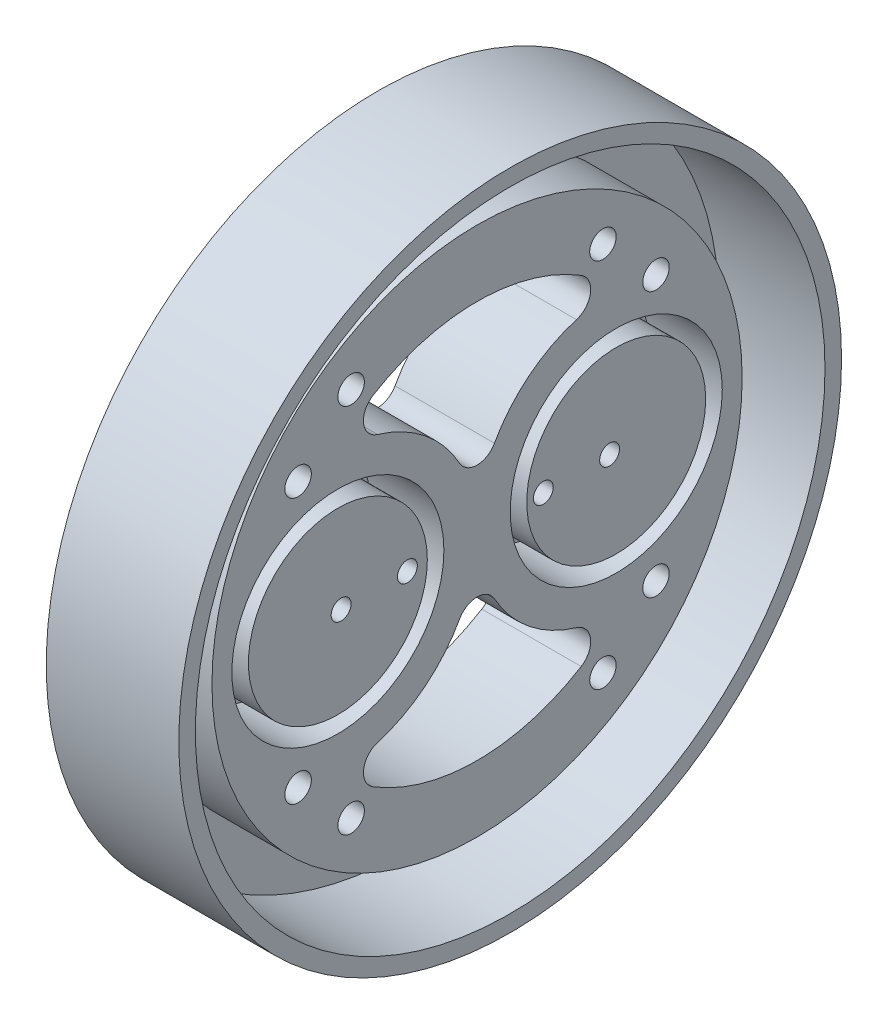
ISO-10303-21;
HEADER;
FILE_DESCRIPTION(('STEP AP214'),'2;1');
FILE_NAME('part.step','',(''),(''),'','','');
FILE_SCHEMA(('AUTOMOTIVE_DESIGN { 1 0 10303 214 1 1 1 1 }'));
ENDSEC;
DATA;
#1=APPLICATION_CONTEXT('core data for automotive mechanical design processes');
#2=APPLICATION_PROTOCOL_DEFINITION('international standard','automotive_design',2000,#1);
#3=PRODUCT_CONTEXT('',#1,'mechanical');
#4=PRODUCT('Part','Part','',(#3));
#5=PRODUCT_RELATED_PRODUCT_CATEGORY('part','',(#4));
#6=PRODUCT_DEFINITION_FORMATION('','',#4);
#7=PRODUCT_DEFINITION_CONTEXT('part definition',#1,'design');
#8=PRODUCT_DEFINITION('design','',#6,#7);
#9=PRODUCT_DEFINITION_SHAPE('','',#8);
#10=(LENGTH_UNIT() NAMED_UNIT(*) SI_UNIT(.MILLI.,.METRE.));
#11=(NAMED_UNIT(*) PLANE_ANGLE_UNIT() SI_UNIT($,.RADIAN.));
#12=(NAMED_UNIT(*) SI_UNIT($,.STERADIAN.) SOLID_ANGLE_UNIT());
#13=UNCERTAINTY_MEASURE_WITH_UNIT(LENGTH_MEASURE(1.E-05),#10,'distance_accuracy_value','');
#14=(GEOMETRIC_REPRESENTATION_CONTEXT(3) GLOBAL_UNCERTAINTY_ASSIGNED_CONTEXT((#13)) GLOBAL_UNIT_ASSIGNED_CONTEXT((#10,
#11,#12)) REPRESENTATION_CONTEXT('',''));
#15=CARTESIAN_POINT('',(0.,0.,0.));
#16=DIRECTION('',(0.,0.,1.));
#17=DIRECTION('',(1.,0.,0.));
#18=AXIS2_PLACEMENT_3D('',#15,#16,#17);
#19=CARTESIAN_POINT('',(4.,0.,0.));
#20=DIRECTION('',(1.,0.,0.));
#21=DIRECTION('',(0.,0.,-1.));
#22=AXIS2_PLACEMENT_3D('',#19,#20,#21);
#23=PLANE('',#22);
#24=CARTESIAN_POINT('',(4.,0.,0.));
#25=DIRECTION('',(1.,0.,0.));
#26=DIRECTION('',(0.,0.,-1.));
#27=AXIS2_PLACEMENT_3D('',#24,#25,#26);
#28=CIRCLE('',#27,47.5);
#29=CARTESIAN_POINT('',(4.,0.,-47.5));
#30=VERTEX_POINT('',#29);
#31=EDGE_CURVE('E261',#30,#30,#28,.T.);
#32=ORIENTED_EDGE('',*,*,#31,.T.);
#33=EDGE_LOOP('',(#32));
#34=FACE_BOUND('',#33,.T.);
#35=CARTESIAN_POINT('',(4.,0.,0.));
#36=DIRECTION('',(1.,0.,0.));
#37=DIRECTION('',(0.,0.,-1.));
#38=AXIS2_PLACEMENT_3D('',#35,#36,#37);
#39=CIRCLE('',#38,40.);
#40=CARTESIAN_POINT('',(4.,0.,-40.));
#41=VERTEX_POINT('',#40);
#42=EDGE_CURVE('E207',#41,#41,#39,.F.);
#43=ORIENTED_EDGE('',*,*,#42,.T.);
#44=EDGE_LOOP('',(#43));
#45=FACE_BOUND('',#44,.T.);
#46=ADVANCED_FACE('F53',(#34,#45),#23,.T.);
#47=CARTESIAN_POINT('',(20.,0.,0.));
#48=DIRECTION('',(-1.,0.,0.));
#49=DIRECTION('',(0.,0.,1.));
#50=AXIS2_PLACEMENT_3D('',#47,#48,#49);
#51=CYLINDRICAL_SURFACE('',#50,47.5);
#52=ORIENTED_EDGE('',*,*,#31,.F.);
#53=EDGE_LOOP('',(#52));
#54=FACE_BOUND('',#53,.T.);
#55=CARTESIAN_POINT('',(20.,0.,0.));
#56=DIRECTION('',(1.,0.,0.));
#57=DIRECTION('',(0.,0.,-1.));
#58=AXIS2_PLACEMENT_3D('',#55,#56,#57);
#59=CIRCLE('',#58,47.5);
#60=CARTESIAN_POINT('',(20.,0.,-47.5));
#61=VERTEX_POINT('',#60);
#62=EDGE_CURVE('E265',#61,#61,#59,.T.);
#63=ORIENTED_EDGE('',*,*,#62,.T.);
#64=EDGE_LOOP('',(#63));
#65=FACE_BOUND('',#64,.T.);
#66=ADVANCED_FACE('F55',(#54,#65),#51,.F.);
#67=CARTESIAN_POINT('',(20.,0.,0.));
#68=DIRECTION('',(-1.,0.,0.));
#69=DIRECTION('',(0.,0.,1.));
#70=AXIS2_PLACEMENT_3D('',#67,#68,#69);
#71=CYLINDRICAL_SURFACE('',#70,50.);
#72=CARTESIAN_POINT('',(20.,0.,0.));
#73=DIRECTION('',(1.,0.,0.));
#74=DIRECTION('',(0.,0.,-1.));
#75=AXIS2_PLACEMENT_3D('',#72,#73,#74);
#76=CIRCLE('',#75,50.);
#77=CARTESIAN_POINT('',(20.,0.,-50.));
#78=VERTEX_POINT('',#77);
#79=EDGE_CURVE('E264',#78,#78,#76,.T.);
#80=ORIENTED_EDGE('',*,*,#79,.F.);
#81=EDGE_LOOP('',(#80));
#82=FACE_BOUND('',#81,.T.);
#83=CARTESIAN_POINT('',(0.,0.,0.));
#84=DIRECTION('',(1.,0.,0.));
#85=DIRECTION('',(0.,0.,-1.));
#86=AXIS2_PLACEMENT_3D('',#83,#84,#85);
#87=CIRCLE('',#86,50.);
#88=CARTESIAN_POINT('',(0.,0.,-50.));
#89=VERTEX_POINT('',#88);
#90=EDGE_CURVE('E251',#89,#89,#87,.T.);
#91=ORIENTED_EDGE('',*,*,#90,.T.);
#92=EDGE_LOOP('',(#91));
#93=FACE_BOUND('',#92,.T.);
#94=ADVANCED_FACE('F401',(#82,#93),#71,.T.);
#95=CARTESIAN_POINT('',(20.,0.,0.));
#96=DIRECTION('',(1.,0.,0.));
#97=DIRECTION('',(0.,0.,-1.));
#98=AXIS2_PLACEMENT_3D('',#95,#96,#97);
#99=PLANE('',#98);
#100=ORIENTED_EDGE('',*,*,#62,.F.);
#101=EDGE_LOOP('',(#100));
#102=FACE_BOUND('',#101,.T.);
#103=ORIENTED_EDGE('',*,*,#79,.T.);
#104=EDGE_LOOP('',(#103));
#105=FACE_BOUND('',#104,.T.);
#106=ADVANCED_FACE('F451',(#102,#105),#99,.T.);
#107=CARTESIAN_POINT('',(0.,0.,0.));
#108=DIRECTION('',(1.,0.,0.));
#109=DIRECTION('',(0.,0.,-1.));
#110=AXIS2_PLACEMENT_3D('',#107,#108,#109);
#111=PLANE('',#110);
#112=CARTESIAN_POINT('',(0.,-28.,19.));
#113=DIRECTION('',(1.,0.,0.));
#114=DIRECTION('',(0.,0.,-1.));
#115=AXIS2_PLACEMENT_3D('',#112,#113,#114);
#116=CIRCLE('',#115,2.);
#117=CARTESIAN_POINT('',(0.,-28.,17.));
#118=VERTEX_POINT('',#117);
#119=EDGE_CURVE('E338',#118,#118,#116,.T.);
#120=ORIENTED_EDGE('',*,*,#119,.T.);
#121=EDGE_LOOP('',(#120));
#122=FACE_BOUND('',#121,.T.);
#123=CARTESIAN_POINT('',(0.,0.,20.508));
#124=DIRECTION('',(1.,0.,0.));
#125=DIRECTION('',(0.,0.,-1.));
#126=AXIS2_PLACEMENT_3D('',#123,#124,#125);
#127=CIRCLE('',#126,1.5);
#128=CARTESIAN_POINT('',(0.,0.,19.008));
#129=VERTEX_POINT('',#128);
#130=EDGE_CURVE('E332',#129,#129,#127,.T.);
#131=ORIENTED_EDGE('',*,*,#130,.T.);
#132=EDGE_LOOP('',(#131));
#133=FACE_BOUND('',#132,.T.);
#134=CARTESIAN_POINT('',(0.,0.,10.508));
#135=DIRECTION('',(1.,0.,0.));
#136=DIRECTION('',(0.,0.,-1.));
#137=AXIS2_PLACEMENT_3D('',#134,#135,#136);
#138=CIRCLE('',#137,1.5);
#139=CARTESIAN_POINT('',(0.,0.,9.008));
#140=VERTEX_POINT('',#139);
#141=EDGE_CURVE('E326',#140,#140,#138,.T.);
#142=ORIENTED_EDGE('',*,*,#141,.T.);
#143=EDGE_LOOP('',(#142));
#144=FACE_BOUND('',#143,.T.);
#145=CARTESIAN_POINT('',(0.,0.,-10.));
#146=DIRECTION('',(1.,0.,0.));
#147=DIRECTION('',(0.,0.,-1.));
#148=AXIS2_PLACEMENT_3D('',#145,#146,#147);
#149=CIRCLE('',#148,1.5);
#150=CARTESIAN_POINT('',(0.,0.,-11.5));
#151=VERTEX_POINT('',#150);
#152=EDGE_CURVE('E320',#151,#151,#149,.T.);
#153=ORIENTED_EDGE('',*,*,#152,.T.);
#154=EDGE_LOOP('',(#153));
#155=FACE_BOUND('',#154,.T.);
#156=CARTESIAN_POINT('',(0.,0.,-20.));
#157=DIRECTION('',(1.,0.,0.));
#158=DIRECTION('',(0.,0.,-1.));
#159=AXIS2_PLACEMENT_3D('',#156,#157,#158);
#160=CIRCLE('',#159,1.5);
#161=CARTESIAN_POINT('',(0.,0.,-21.5));
#162=VERTEX_POINT('',#161);
#163=EDGE_CURVE('E314',#162,#162,#160,.T.);
#164=ORIENTED_EDGE('',*,*,#163,.T.);
#165=EDGE_LOOP('',(#164));
#166=FACE_BOUND('',#165,.T.);
#167=CARTESIAN_POINT('',(0.,-28.,-19.));
#168=DIRECTION('',(1.,0.,0.));
#169=DIRECTION('',(0.,0.,1.));
#170=AXIS2_PLACEMENT_3D('',#167,#168,#169);
#171=CIRCLE('',#170,2.);
#172=CARTESIAN_POINT('',(0.,-28.,-17.));
#173=VERTEX_POINT('',#172);
#174=EDGE_CURVE('E308',#173,#173,#171,.T.);
#175=ORIENTED_EDGE('',*,*,#174,.T.);
#176=EDGE_LOOP('',(#175));
#177=FACE_BOUND('',#176,.T.);
#178=CARTESIAN_POINT('',(0.,-20.,-27.));
#179=DIRECTION('',(1.,0.,0.));
#180=DIRECTION('',(0.,0.,1.));
#181=AXIS2_PLACEMENT_3D('',#178,#179,#180);
#182=CIRCLE('',#181,2.);
#183=CARTESIAN_POINT('',(0.,-20.,-25.));
#184=VERTEX_POINT('',#183);
#185=EDGE_CURVE('E302',#184,#184,#182,.T.);
#186=ORIENTED_EDGE('',*,*,#185,.T.);
#187=EDGE_LOOP('',(#186));
#188=FACE_BOUND('',#187,.T.);
#189=CARTESIAN_POINT('',(0.,20.,-27.));
#190=DIRECTION('',(1.,0.,0.));
#191=DIRECTION('',(0.,0.,-1.));
#192=AXIS2_PLACEMENT_3D('',#189,#190,#191);
#193=CIRCLE('',#192,2.);
#194=CARTESIAN_POINT('',(0.,20.,-29.));
#195=VERTEX_POINT('',#194);
#196=EDGE_CURVE('E295',#195,#195,#193,.T.);
#197=ORIENTED_EDGE('',*,*,#196,.T.);
#198=EDGE_LOOP('',(#197));
#199=FACE_BOUND('',#198,.T.);
#200=CARTESIAN_POINT('',(0.,28.,-19.));
#201=DIRECTION('',(1.,0.,0.));
#202=DIRECTION('',(0.,0.,-1.));
#203=AXIS2_PLACEMENT_3D('',#200,#201,#202);
#204=CIRCLE('',#203,2.);
#205=CARTESIAN_POINT('',(0.,28.,-21.));
#206=VERTEX_POINT('',#205);
#207=EDGE_CURVE('E355',#206,#206,#204,.T.);
#208=ORIENTED_EDGE('',*,*,#207,.T.);
#209=EDGE_LOOP('',(#208));
#210=FACE_BOUND('',#209,.T.);
#211=CARTESIAN_POINT('',(0.,28.,19.));
#212=DIRECTION('',(1.,0.,0.));
#213=DIRECTION('',(0.,0.,1.));
#214=AXIS2_PLACEMENT_3D('',#211,#212,#213);
#215=CIRCLE('',#214,2.);
#216=CARTESIAN_POINT('',(0.,28.,21.));
#217=VERTEX_POINT('',#216);
#218=EDGE_CURVE('E349',#217,#217,#215,.T.);
#219=ORIENTED_EDGE('',*,*,#218,.T.);
#220=EDGE_LOOP('',(#219));
#221=FACE_BOUND('',#220,.T.);
#222=CARTESIAN_POINT('',(0.,20.,27.));
#223=DIRECTION('',(1.,0.,0.));
#224=DIRECTION('',(0.,0.,1.));
#225=AXIS2_PLACEMENT_3D('',#222,#223,#224);
#226=CIRCLE('',#225,2.);
#227=CARTESIAN_POINT('',(0.,20.,29.));
#228=VERTEX_POINT('',#227);
#229=EDGE_CURVE('E343',#228,#228,#226,.T.);
#230=ORIENTED_EDGE('',*,*,#229,.T.);
#231=EDGE_LOOP('',(#230));
#232=FACE_BOUND('',#231,.T.);
#233=CARTESIAN_POINT('',(0.,-20.,27.));
#234=DIRECTION('',(1.,0.,0.));
#235=DIRECTION('',(0.,0.,-1.));
#236=AXIS2_PLACEMENT_3D('',#233,#234,#235);
#237=CIRCLE('',#236,2.);
#238=CARTESIAN_POINT('',(0.,-20.,25.));
#239=VERTEX_POINT('',#238);
#240=EDGE_CURVE('E286',#239,#239,#237,.T.);
#241=ORIENTED_EDGE('',*,*,#240,.T.);
#242=EDGE_LOOP('',(#241));
#243=FACE_BOUND('',#242,.T.);
#244=ORIENTED_EDGE('',*,*,#90,.F.);
#245=EDGE_LOOP('',(#244));
#246=FACE_BOUND('',#245,.T.);
#247=CARTESIAN_POINT('',(0.,0.,-21.));
#248=DIRECTION('',(1.,0.,0.));
#249=DIRECTION('',(0.,0.,-1.));
#250=AXIS2_PLACEMENT_3D('',#247,#248,#249);
#251=CIRCLE('',#250,21.);
#252=CARTESIAN_POINT('',(0.,10.1665812837945,-2.625));
#253=VERTEX_POINT('',#252);
#254=CARTESIAN_POINT('',(0.,20.1246117974981,-15.));
#255=VERTEX_POINT('',#254);
#256=EDGE_CURVE('E150',#253,#255,#251,.F.);
#257=ORIENTED_EDGE('',*,*,#256,.T.);
#258=CARTESIAN_POINT('',(0.,22.9995563399978,-14.1428571428571));
#259=DIRECTION('',(1.,0.,0.));
#260=DIRECTION('',(0.,0.,-1.));
#261=AXIS2_PLACEMENT_3D('',#258,#259,#260);
#262=CIRCLE('',#261,3.);
#263=CARTESIAN_POINT('',(0.,25.5550625999976,-15.7142857142857));
#264=VERTEX_POINT('',#263);
#265=EDGE_CURVE('E221',#255,#264,#262,.T.);
#266=ORIENTED_EDGE('',*,*,#265,.T.);
#267=CARTESIAN_POINT('',(0.,0.,0.));
#268=DIRECTION('',(1.,0.,0.));
#269=DIRECTION('',(0.,0.,-1.));
#270=AXIS2_PLACEMENT_3D('',#267,#268,#269);
#271=CIRCLE('',#270,30.);
#272=CARTESIAN_POINT('',(0.,25.5550625999976,15.7142857142857));
#273=VERTEX_POINT('',#272);
#274=EDGE_CURVE('E218',#264,#273,#271,.T.);
#275=ORIENTED_EDGE('',*,*,#274,.T.);
#276=CARTESIAN_POINT('',(0.,22.9995563399978,14.1428571428571));
#277=DIRECTION('',(1.,0.,0.));
#278=DIRECTION('',(0.,0.,-1.));
#279=AXIS2_PLACEMENT_3D('',#276,#277,#278);
#280=CIRCLE('',#279,3.);
#281=CARTESIAN_POINT('',(0.,20.1246117974981,15.));
#282=VERTEX_POINT('',#281);
#283=EDGE_CURVE('E215',#282,#273,#280,.F.);
#284=ORIENTED_EDGE('',*,*,#283,.F.);
#285=CARTESIAN_POINT('',(0.,0.,21.));
#286=DIRECTION('',(1.,0.,0.));
#287=DIRECTION('',(0.,0.,-1.));
#288=AXIS2_PLACEMENT_3D('',#285,#286,#287);
#289=CIRCLE('',#288,21.);
#290=CARTESIAN_POINT('',(0.,10.1665812837945,2.625));
#291=VERTEX_POINT('',#290);
#292=EDGE_CURVE('E212',#291,#282,#289,.T.);
#293=ORIENTED_EDGE('',*,*,#292,.F.);
#294=CARTESIAN_POINT('',(0.,11.6189500386222,0.));
#295=DIRECTION('',(1.,0.,0.));
#296=DIRECTION('',(0.,0.,-1.));
#297=AXIS2_PLACEMENT_3D('',#294,#295,#296);
#298=CIRCLE('',#297,3.);
#299=EDGE_CURVE('E209',#291,#253,#298,.T.);
#300=ORIENTED_EDGE('',*,*,#299,.T.);
#301=EDGE_LOOP('',(#257,#266,#275,#284,#293,#300));
#302=FACE_BOUND('',#301,.T.);
#303=CARTESIAN_POINT('',(0.,0.,-21.));
#304=DIRECTION('',(1.,0.,0.));
#305=DIRECTION('',(0.,0.,-1.));
#306=AXIS2_PLACEMENT_3D('',#303,#304,#305);
#307=CIRCLE('',#306,21.);
#308=CARTESIAN_POINT('',(0.,-20.1246117974981,-15.));
#309=VERTEX_POINT('',#308);
#310=CARTESIAN_POINT('',(0.,-10.1665812837945,-2.62500000000001));
#311=VERTEX_POINT('',#310);
#312=EDGE_CURVE('E224',#309,#311,#307,.F.);
#313=ORIENTED_EDGE('',*,*,#312,.T.);
#314=CARTESIAN_POINT('',(0.,-11.6189500386222,0.));
#315=DIRECTION('',(1.,0.,0.));
#316=DIRECTION('',(0.,0.,-1.));
#317=AXIS2_PLACEMENT_3D('',#314,#315,#316);
#318=CIRCLE('',#317,3.);
#319=CARTESIAN_POINT('',(0.,-10.1665812837945,2.62500000000001));
#320=VERTEX_POINT('',#319);
#321=EDGE_CURVE('E237',#311,#320,#318,.T.);
#322=ORIENTED_EDGE('',*,*,#321,.T.);
#323=CARTESIAN_POINT('',(0.,0.,21.));
#324=DIRECTION('',(1.,0.,0.));
#325=DIRECTION('',(0.,0.,-1.));
#326=AXIS2_PLACEMENT_3D('',#323,#324,#325);
#327=CIRCLE('',#326,21.);
#328=CARTESIAN_POINT('',(0.,-20.1246117974981,15.));
#329=VERTEX_POINT('',#328);
#330=EDGE_CURVE('E235',#329,#320,#327,.T.);
#331=ORIENTED_EDGE('',*,*,#330,.F.);
#332=CARTESIAN_POINT('',(0.,-22.9995563399978,14.1428571428571));
#333=DIRECTION('',(1.,0.,0.));
#334=DIRECTION('',(0.,0.,-1.));
#335=AXIS2_PLACEMENT_3D('',#332,#333,#334);
#336=CIRCLE('',#335,3.);
#337=CARTESIAN_POINT('',(0.,-25.5550625999976,15.7142857142857));
#338=VERTEX_POINT('',#337);
#339=EDGE_CURVE('E232',#329,#338,#336,.T.);
#340=ORIENTED_EDGE('',*,*,#339,.T.);
#341=CARTESIAN_POINT('',(0.,0.,0.));
#342=DIRECTION('',(1.,0.,0.));
#343=DIRECTION('',(0.,0.,-1.));
#344=AXIS2_PLACEMENT_3D('',#341,#342,#343);
#345=CIRCLE('',#344,30.);
#346=CARTESIAN_POINT('',(0.,-25.5550625999976,-15.7142857142857));
#347=VERTEX_POINT('',#346);
#348=EDGE_CURVE('E229',#338,#347,#345,.T.);
#349=ORIENTED_EDGE('',*,*,#348,.T.);
#350=CARTESIAN_POINT('',(0.,-22.9995563399978,-14.1428571428571));
#351=DIRECTION('',(1.,0.,0.));
#352=DIRECTION('',(0.,0.,-1.));
#353=AXIS2_PLACEMENT_3D('',#350,#351,#352);
#354=CIRCLE('',#353,3.);
#355=EDGE_CURVE('E226',#309,#347,#354,.F.);
#356=ORIENTED_EDGE('',*,*,#355,.F.);
#357=EDGE_LOOP('',(#313,#322,#331,#340,#349,#356));
#358=FACE_BOUND('',#357,.T.);
#359=ADVANCED_FACE('F449',(#122,#133,#144,#155,#166,#177,#188,#199,#210,#221,#232,#243,#246,
#302,#358),#111,.F.);
#360=CARTESIAN_POINT('',(4.,0.,-21.));
#361=DIRECTION('',(-1.,0.,0.));
#362=DIRECTION('',(0.,0.,1.));
#363=AXIS2_PLACEMENT_3D('',#360,#361,#362);
#364=CYLINDRICAL_SURFACE('',#363,21.);
#365=ORIENTED_EDGE('',*,*,#312,.F.);
#366=DIRECTION('',(-1.,0.,0.));
#367=VECTOR('',#366,1.);
#368=CARTESIAN_POINT('',(4.,-20.1246117974981,-15.));
#369=LINE('',#368,#367);
#370=CARTESIAN_POINT('',(15.,-20.1246117974981,-15.));
#371=VERTEX_POINT('',#370);
#372=EDGE_CURVE('E249',#371,#309,#369,.T.);
#373=ORIENTED_EDGE('',*,*,#372,.F.);
#374=CARTESIAN_POINT('',(15.,0.,-21.));
#375=DIRECTION('',(1.,0.,0.));
#376=DIRECTION('',(0.,0.,-1.));
#377=AXIS2_PLACEMENT_3D('',#374,#375,#376);
#378=CIRCLE('',#377,21.);
#379=CARTESIAN_POINT('',(15.,-10.1665812837945,-2.62500000000001));
#380=VERTEX_POINT('',#379);
#381=EDGE_CURVE('E191',#371,#380,#378,.F.);
#382=ORIENTED_EDGE('',*,*,#381,.T.);
#383=DIRECTION('',(-1.,0.,0.));
#384=VECTOR('',#383,1.);
#385=CARTESIAN_POINT('',(4.,-10.1665812837945,-2.62500000000001));
#386=LINE('',#385,#384);
#387=EDGE_CURVE('E68',#380,#311,#386,.T.);
#388=ORIENTED_EDGE('',*,*,#387,.T.);
#389=EDGE_LOOP('',(#365,#373,#382,#388));
#390=FACE_BOUND('',#389,.T.);
#391=ADVANCED_FACE('F433',(#390),#364,.T.);
#392=CARTESIAN_POINT('',(4.,-22.9995563399978,-14.1428571428571));
#393=DIRECTION('',(-1.,0.,0.));
#394=DIRECTION('',(0.,0.,1.));
#395=AXIS2_PLACEMENT_3D('',#392,#393,#394);
#396=CYLINDRICAL_SURFACE('',#395,3.);
#397=ORIENTED_EDGE('',*,*,#355,.T.);
#398=DIRECTION('',(-1.,0.,0.));
#399=VECTOR('',#398,1.);
#400=CARTESIAN_POINT('',(4.,-25.5550625999976,-15.7142857142857));
#401=LINE('',#400,#399);
#402=CARTESIAN_POINT('',(15.,-25.5550625999976,-15.7142857142857));
#403=VERTEX_POINT('',#402);
#404=EDGE_CURVE('E247',#403,#347,#401,.T.);
#405=ORIENTED_EDGE('',*,*,#404,.F.);
#406=CARTESIAN_POINT('',(15.,-22.9995563399978,-14.1428571428571));
#407=DIRECTION('',(1.,0.,0.));
#408=DIRECTION('',(0.,0.,-1.));
#409=AXIS2_PLACEMENT_3D('',#406,#407,#408);
#410=CIRCLE('',#409,3.);
#411=EDGE_CURVE('E193',#371,#403,#410,.F.);
#412=ORIENTED_EDGE('',*,*,#411,.F.);
#413=ORIENTED_EDGE('',*,*,#372,.T.);
#414=EDGE_LOOP('',(#397,#405,#412,#413));
#415=FACE_BOUND('',#414,.T.);
#416=ADVANCED_FACE('F436',(#415),#396,.F.);
#417=CARTESIAN_POINT('',(4.,0.,0.));
#418=DIRECTION('',(-1.,0.,0.));
#419=DIRECTION('',(0.,0.,1.));
#420=AXIS2_PLACEMENT_3D('',#417,#418,#419);
#421=CYLINDRICAL_SURFACE('',#420,30.);
#422=ORIENTED_EDGE('',*,*,#348,.F.);
#423=DIRECTION('',(-1.,0.,0.));
#424=VECTOR('',#423,1.);
#425=CARTESIAN_POINT('',(4.,-25.5550625999976,15.7142857142857));
#426=LINE('',#425,#424);
#427=CARTESIAN_POINT('',(15.,-25.5550625999976,15.7142857142857));
#428=VERTEX_POINT('',#427);
#429=EDGE_CURVE('E245',#428,#338,#426,.T.);
#430=ORIENTED_EDGE('',*,*,#429,.F.);
#431=CARTESIAN_POINT('',(15.,0.,0.));
#432=DIRECTION('',(1.,0.,0.));
#433=DIRECTION('',(0.,0.,-1.));
#434=AXIS2_PLACEMENT_3D('',#431,#432,#433);
#435=CIRCLE('',#434,30.);
#436=EDGE_CURVE('E196',#428,#403,#435,.T.);
#437=ORIENTED_EDGE('',*,*,#436,.T.);
#438=ORIENTED_EDGE('',*,*,#404,.T.);
#439=EDGE_LOOP('',(#422,#430,#437,#438));
#440=FACE_BOUND('',#439,.T.);
#441=ADVANCED_FACE('F439',(#440),#421,.F.);
#442=CARTESIAN_POINT('',(4.,-22.9995563399978,14.1428571428571));
#443=DIRECTION('',(-1.,0.,0.));
#444=DIRECTION('',(0.,0.,1.));
#445=AXIS2_PLACEMENT_3D('',#442,#443,#444);
#446=CYLINDRICAL_SURFACE('',#445,3.);
#447=ORIENTED_EDGE('',*,*,#339,.F.);
#448=DIRECTION('',(-1.,0.,0.));
#449=VECTOR('',#448,1.);
#450=CARTESIAN_POINT('',(4.,-20.1246117974981,15.));
#451=LINE('',#450,#449);
#452=CARTESIAN_POINT('',(15.,-20.1246117974981,15.));
#453=VERTEX_POINT('',#452);
#454=EDGE_CURVE('E243',#453,#329,#451,.T.);
#455=ORIENTED_EDGE('',*,*,#454,.F.);
#456=CARTESIAN_POINT('',(15.,-22.9995563399978,14.1428571428571));
#457=DIRECTION('',(1.,0.,0.));
#458=DIRECTION('',(0.,0.,-1.));
#459=AXIS2_PLACEMENT_3D('',#456,#457,#458);
#460=CIRCLE('',#459,3.);
#461=EDGE_CURVE('E199',#453,#428,#460,.T.);
#462=ORIENTED_EDGE('',*,*,#461,.T.);
#463=ORIENTED_EDGE('',*,*,#429,.T.);
#464=EDGE_LOOP('',(#447,#455,#462,#463));
#465=FACE_BOUND('',#464,.T.);
#466=ADVANCED_FACE('F443',(#465),#446,.F.);
#467=CARTESIAN_POINT('',(4.,0.,21.));
#468=DIRECTION('',(-1.,0.,0.));
#469=DIRECTION('',(0.,0.,1.));
#470=AXIS2_PLACEMENT_3D('',#467,#468,#469);
#471=CYLINDRICAL_SURFACE('',#470,21.);
#472=ORIENTED_EDGE('',*,*,#330,.T.);
#473=DIRECTION('',(-1.,0.,0.));
#474=VECTOR('',#473,1.);
#475=CARTESIAN_POINT('',(4.,-10.1665812837945,2.62500000000001));
#476=LINE('',#475,#474);
#477=CARTESIAN_POINT('',(15.,-10.1665812837945,2.62500000000001));
#478=VERTEX_POINT('',#477);
#479=EDGE_CURVE('E76',#478,#320,#476,.T.);
#480=ORIENTED_EDGE('',*,*,#479,.F.);
#481=CARTESIAN_POINT('',(15.,0.,21.));
#482=DIRECTION('',(1.,0.,0.));
#483=DIRECTION('',(0.,0.,-1.));
#484=AXIS2_PLACEMENT_3D('',#481,#482,#483);
#485=CIRCLE('',#484,21.);
#486=EDGE_CURVE('E202',#453,#478,#485,.T.);
#487=ORIENTED_EDGE('',*,*,#486,.F.);
#488=ORIENTED_EDGE('',*,*,#454,.T.);
#489=EDGE_LOOP('',(#472,#480,#487,#488));
#490=FACE_BOUND('',#489,.T.);
#491=ADVANCED_FACE('F447',(#490),#471,.T.);
#492=CARTESIAN_POINT('',(4.,0.,-21.));
#493=DIRECTION('',(-1.,0.,0.));
#494=DIRECTION('',(0.,0.,1.));
#495=AXIS2_PLACEMENT_3D('',#492,#493,#494);
#496=CYLINDRICAL_SURFACE('',#495,21.);
#497=ORIENTED_EDGE('',*,*,#256,.F.);
#498=DIRECTION('',(-1.,0.,0.));
#499=VECTOR('',#498,1.);
#500=CARTESIAN_POINT('',(4.,10.1665812837945,-2.625));
#501=LINE('',#500,#499);
#502=CARTESIAN_POINT('',(15.,10.1665812837945,-2.625));
#503=VERTEX_POINT('',#502);
#504=EDGE_CURVE('E144',#503,#253,#501,.T.);
#505=ORIENTED_EDGE('',*,*,#504,.F.);
#506=CARTESIAN_POINT('',(15.,0.,-21.));
#507=DIRECTION('',(1.,0.,0.));
#508=DIRECTION('',(0.,0.,-1.));
#509=AXIS2_PLACEMENT_3D('',#506,#507,#508);
#510=CIRCLE('',#509,21.);
#511=CARTESIAN_POINT('',(15.,20.1246117974981,-15.));
#512=VERTEX_POINT('',#511);
#513=EDGE_CURVE('E147',#503,#512,#510,.F.);
#514=ORIENTED_EDGE('',*,*,#513,.T.);
#515=DIRECTION('',(-1.,0.,0.));
#516=VECTOR('',#515,1.);
#517=CARTESIAN_POINT('',(4.,20.1246117974981,-15.));
#518=LINE('',#517,#516);
#519=EDGE_CURVE('E240',#512,#255,#518,.T.);
#520=ORIENTED_EDGE('',*,*,#519,.T.);
#521=EDGE_LOOP('',(#497,#505,#514,#520));
#522=FACE_BOUND('',#521,.T.);
#523=ADVANCED_FACE('F146',(#522),#496,.T.);
#524=CARTESIAN_POINT('',(4.,11.6189500386222,0.));
#525=DIRECTION('',(-1.,0.,0.));
#526=DIRECTION('',(0.,0.,1.));
#527=AXIS2_PLACEMENT_3D('',#524,#525,#526);
#528=CYLINDRICAL_SURFACE('',#527,3.);
#529=ORIENTED_EDGE('',*,*,#299,.F.);
#530=DIRECTION('',(-1.,0.,0.));
#531=VECTOR('',#530,1.);
#532=CARTESIAN_POINT('',(4.,10.1665812837945,2.625));
#533=LINE('',#532,#531);
#534=CARTESIAN_POINT('',(15.,10.1665812837945,2.625));
#535=VERTEX_POINT('',#534);
#536=EDGE_CURVE('E155',#535,#291,#533,.T.);
#537=ORIENTED_EDGE('',*,*,#536,.F.);
#538=CARTESIAN_POINT('',(15.,11.6189500386222,0.));
#539=DIRECTION('',(1.,0.,0.));
#540=DIRECTION('',(0.,0.,-1.));
#541=AXIS2_PLACEMENT_3D('',#538,#539,#540);
#542=CIRCLE('',#541,3.);
#543=EDGE_CURVE('E162',#535,#503,#542,.T.);
#544=ORIENTED_EDGE('',*,*,#543,.T.);
#545=ORIENTED_EDGE('',*,*,#504,.T.);
#546=EDGE_LOOP('',(#529,#537,#544,#545));
#547=FACE_BOUND('',#546,.T.);
#548=ADVANCED_FACE('F168',(#547),#528,.F.);
#549=CARTESIAN_POINT('',(4.,0.,21.));
#550=DIRECTION('',(-1.,0.,0.));
#551=DIRECTION('',(0.,0.,1.));
#552=AXIS2_PLACEMENT_3D('',#549,#550,#551);
#553=CYLINDRICAL_SURFACE('',#552,21.);
#554=ORIENTED_EDGE('',*,*,#292,.T.);
#555=DIRECTION('',(-1.,0.,0.));
#556=VECTOR('',#555,1.);
#557=CARTESIAN_POINT('',(4.,20.1246117974981,15.));
#558=LINE('',#557,#556);
#559=CARTESIAN_POINT('',(15.,20.1246117974981,15.));
#560=VERTEX_POINT('',#559);
#561=EDGE_CURVE('E257',#560,#282,#558,.T.);
#562=ORIENTED_EDGE('',*,*,#561,.F.);
#563=CARTESIAN_POINT('',(15.,0.,21.));
#564=DIRECTION('',(1.,0.,0.));
#565=DIRECTION('',(0.,0.,-1.));
#566=AXIS2_PLACEMENT_3D('',#563,#564,#565);
#567=CIRCLE('',#566,21.);
#568=EDGE_CURVE('E170',#535,#560,#567,.T.);
#569=ORIENTED_EDGE('',*,*,#568,.F.);
#570=ORIENTED_EDGE('',*,*,#536,.T.);
#571=EDGE_LOOP('',(#554,#562,#569,#570));
#572=FACE_BOUND('',#571,.T.);
#573=ADVANCED_FACE('F483',(#572),#553,.T.);
#574=CARTESIAN_POINT('',(4.,22.9995563399978,14.1428571428571));
#575=DIRECTION('',(-1.,0.,0.));
#576=DIRECTION('',(0.,0.,1.));
#577=AXIS2_PLACEMENT_3D('',#574,#575,#576);
#578=CYLINDRICAL_SURFACE('',#577,3.);
#579=ORIENTED_EDGE('',*,*,#283,.T.);
#580=DIRECTION('',(-1.,0.,0.));
#581=VECTOR('',#580,1.);
#582=CARTESIAN_POINT('',(4.,25.5550625999976,15.7142857142857));
#583=LINE('',#582,#581);
#584=CARTESIAN_POINT('',(15.,25.5550625999976,15.7142857142857));
#585=VERTEX_POINT('',#584);
#586=EDGE_CURVE('E255',#585,#273,#583,.T.);
#587=ORIENTED_EDGE('',*,*,#586,.F.);
#588=CARTESIAN_POINT('',(15.,22.9995563399978,14.1428571428571));
#589=DIRECTION('',(1.,0.,0.));
#590=DIRECTION('',(0.,0.,-1.));
#591=AXIS2_PLACEMENT_3D('',#588,#589,#590);
#592=CIRCLE('',#591,3.);
#593=EDGE_CURVE('E172',#560,#585,#592,.F.);
#594=ORIENTED_EDGE('',*,*,#593,.F.);
#595=ORIENTED_EDGE('',*,*,#561,.T.);
#596=EDGE_LOOP('',(#579,#587,#594,#595));
#597=FACE_BOUND('',#596,.T.);
#598=ADVANCED_FACE('F481',(#597),#578,.F.);
#599=CARTESIAN_POINT('',(4.,0.,0.));
#600=DIRECTION('',(-1.,0.,0.));
#601=DIRECTION('',(0.,0.,1.));
#602=AXIS2_PLACEMENT_3D('',#599,#600,#601);
#603=CYLINDRICAL_SURFACE('',#602,30.);
#604=ORIENTED_EDGE('',*,*,#274,.F.);
#605=DIRECTION('',(-1.,0.,0.));
#606=VECTOR('',#605,1.);
#607=CARTESIAN_POINT('',(4.,25.5550625999976,-15.7142857142857));
#608=LINE('',#607,#606);
#609=CARTESIAN_POINT('',(15.,25.5550625999976,-15.7142857142857));
#610=VERTEX_POINT('',#609);
#611=EDGE_CURVE('E253',#610,#264,#608,.T.);
#612=ORIENTED_EDGE('',*,*,#611,.F.);
#613=CARTESIAN_POINT('',(15.,0.,0.));
#614=DIRECTION('',(1.,0.,0.));
#615=DIRECTION('',(0.,0.,-1.));
#616=AXIS2_PLACEMENT_3D('',#613,#614,#615);
#617=CIRCLE('',#616,30.);
#618=EDGE_CURVE('E178',#610,#585,#617,.T.);
#619=ORIENTED_EDGE('',*,*,#618,.T.);
#620=ORIENTED_EDGE('',*,*,#586,.T.);
#621=EDGE_LOOP('',(#604,#612,#619,#620));
#622=FACE_BOUND('',#621,.T.);
#623=ADVANCED_FACE('F478',(#622),#603,.F.);
#624=CARTESIAN_POINT('',(4.,22.9995563399978,-14.1428571428571));
#625=DIRECTION('',(-1.,0.,0.));
#626=DIRECTION('',(0.,0.,1.));
#627=AXIS2_PLACEMENT_3D('',#624,#625,#626);
#628=CYLINDRICAL_SURFACE('',#627,3.);
#629=ORIENTED_EDGE('',*,*,#265,.F.);
#630=ORIENTED_EDGE('',*,*,#519,.F.);
#631=CARTESIAN_POINT('',(15.,22.9995563399978,-14.1428571428571));
#632=DIRECTION('',(1.,0.,0.));
#633=DIRECTION('',(0.,0.,-1.));
#634=AXIS2_PLACEMENT_3D('',#631,#632,#633);
#635=CIRCLE('',#634,3.);
#636=EDGE_CURVE('E165',#512,#610,#635,.T.);
#637=ORIENTED_EDGE('',*,*,#636,.T.);
#638=ORIENTED_EDGE('',*,*,#611,.T.);
#639=EDGE_LOOP('',(#629,#630,#637,#638));
#640=FACE_BOUND('',#639,.T.);
#641=ADVANCED_FACE('F475',(#640),#628,.F.);
#642=CARTESIAN_POINT('',(4.,-11.6189500386222,0.));
#643=DIRECTION('',(-1.,0.,0.));
#644=DIRECTION('',(0.,0.,1.));
#645=AXIS2_PLACEMENT_3D('',#642,#643,#644);
#646=CYLINDRICAL_SURFACE('',#645,3.);
#647=ORIENTED_EDGE('',*,*,#321,.F.);
#648=ORIENTED_EDGE('',*,*,#387,.F.);
#649=CARTESIAN_POINT('',(15.,-11.6189500386222,0.));
#650=DIRECTION('',(1.,0.,0.));
#651=DIRECTION('',(0.,0.,-1.));
#652=AXIS2_PLACEMENT_3D('',#649,#650,#651);
#653=CIRCLE('',#652,3.);
#654=EDGE_CURVE('E205',#380,#478,#653,.T.);
#655=ORIENTED_EDGE('',*,*,#654,.T.);
#656=ORIENTED_EDGE('',*,*,#479,.T.);
#657=EDGE_LOOP('',(#647,#648,#655,#656));
#658=FACE_BOUND('',#657,.T.);
#659=ADVANCED_FACE('F424',(#658),#646,.F.);
#660=CARTESIAN_POINT('',(15.,0.,-21.));
#661=DIRECTION('',(-1.,0.,0.));
#662=DIRECTION('',(0.,0.,1.));
#663=AXIS2_PLACEMENT_3D('',#660,#661,#662);
#664=CYLINDRICAL_SURFACE('',#663,16.);
#665=CARTESIAN_POINT('',(4.,0.,-21.));
#666=DIRECTION('',(1.,0.,0.));
#667=DIRECTION('',(0.,0.,-1.));
#668=AXIS2_PLACEMENT_3D('',#665,#666,#667);
#669=CIRCLE('',#668,16.);
#670=CARTESIAN_POINT('',(4.,0.,-37.));
#671=VERTEX_POINT('',#670);
#672=EDGE_CURVE('E210',#671,#671,#669,.T.);
#673=ORIENTED_EDGE('',*,*,#672,.F.);
#674=EDGE_LOOP('',(#673));
#675=FACE_BOUND('',#674,.T.);
#676=CARTESIAN_POINT('',(15.,0.,-21.));
#677=DIRECTION('',(1.,0.,0.));
#678=DIRECTION('',(0.,0.,-1.));
#679=AXIS2_PLACEMENT_3D('',#676,#677,#678);
#680=CIRCLE('',#679,16.);
#681=CARTESIAN_POINT('',(15.,0.,-37.));
#682=VERTEX_POINT('',#681);
#683=EDGE_CURVE('E188',#682,#682,#680,.F.);
#684=ORIENTED_EDGE('',*,*,#683,.F.);
#685=EDGE_LOOP('',(#684));
#686=FACE_BOUND('',#685,.T.);
#687=ADVANCED_FACE('F420',(#675,#686),#664,.F.);
#688=CARTESIAN_POINT('',(15.,0.,21.));
#689=DIRECTION('',(-1.,0.,0.));
#690=DIRECTION('',(0.,0.,1.));
#691=AXIS2_PLACEMENT_3D('',#688,#689,#690);
#692=CYLINDRICAL_SURFACE('',#691,16.);
#693=CARTESIAN_POINT('',(4.,0.,21.));
#694=DIRECTION('',(1.,0.,0.));
#695=DIRECTION('',(0.,0.,-1.));
#696=AXIS2_PLACEMENT_3D('',#693,#694,#695);
#697=CIRCLE('',#696,16.);
#698=CARTESIAN_POINT('',(4.,0.,5.));
#699=VERTEX_POINT('',#698);
#700=EDGE_CURVE('E61',#699,#699,#697,.F.);
#701=ORIENTED_EDGE('',*,*,#700,.T.);
#702=EDGE_LOOP('',(#701));
#703=FACE_BOUND('',#702,.T.);
#704=CARTESIAN_POINT('',(15.,0.,21.));
#705=DIRECTION('',(1.,0.,0.));
#706=DIRECTION('',(0.,0.,-1.));
#707=AXIS2_PLACEMENT_3D('',#704,#705,#706);
#708=CIRCLE('',#707,16.);
#709=CARTESIAN_POINT('',(15.,0.,5.));
#710=VERTEX_POINT('',#709);
#711=EDGE_CURVE('E185',#710,#710,#708,.T.);
#712=ORIENTED_EDGE('',*,*,#711,.T.);
#713=EDGE_LOOP('',(#712));
#714=FACE_BOUND('',#713,.T.);
#715=ADVANCED_FACE('F423',(#703,#714),#692,.F.);
#716=CARTESIAN_POINT('',(15.,0.,0.));
#717=DIRECTION('',(-1.,0.,0.));
#718=DIRECTION('',(0.,0.,1.));
#719=AXIS2_PLACEMENT_3D('',#716,#717,#718);
#720=CYLINDRICAL_SURFACE('',#719,40.);
#721=ORIENTED_EDGE('',*,*,#42,.F.);
#722=EDGE_LOOP('',(#721));
#723=FACE_BOUND('',#722,.T.);
#724=CARTESIAN_POINT('',(15.,0.,0.));
#725=DIRECTION('',(1.,0.,0.));
#726=DIRECTION('',(0.,0.,-1.));
#727=AXIS2_PLACEMENT_3D('',#724,#725,#726);
#728=CIRCLE('',#727,40.);
#729=CARTESIAN_POINT('',(15.,0.,-40.));
#730=VERTEX_POINT('',#729);
#731=EDGE_CURVE('E182',#730,#730,#728,.T.);
#732=ORIENTED_EDGE('',*,*,#731,.F.);
#733=EDGE_LOOP('',(#732));
#734=FACE_BOUND('',#733,.T.);
#735=ADVANCED_FACE('F366',(#723,#734),#720,.T.);
#736=CARTESIAN_POINT('',(15.,0.,0.));
#737=DIRECTION('',(1.,0.,0.));
#738=DIRECTION('',(0.,0.,-1.));
#739=AXIS2_PLACEMENT_3D('',#736,#737,#738);
#740=PLANE('',#739);
#741=CARTESIAN_POINT('',(15.,-28.,19.));
#742=DIRECTION('',(1.,0.,0.));
#743=DIRECTION('',(0.,0.,-1.));
#744=AXIS2_PLACEMENT_3D('',#741,#742,#743);
#745=CIRCLE('',#744,2.);
#746=CARTESIAN_POINT('',(15.,-28.,17.));
#747=VERTEX_POINT('',#746);
#748=EDGE_CURVE('E292',#747,#747,#745,.T.);
#749=ORIENTED_EDGE('',*,*,#748,.F.);
#750=EDGE_LOOP('',(#749));
#751=FACE_BOUND('',#750,.T.);
#752=CARTESIAN_POINT('',(15.,-28.,-19.));
#753=DIRECTION('',(1.,0.,0.));
#754=DIRECTION('',(0.,0.,1.));
#755=AXIS2_PLACEMENT_3D('',#752,#753,#754);
#756=CIRCLE('',#755,2.);
#757=CARTESIAN_POINT('',(15.,-28.,-17.));
#758=VERTEX_POINT('',#757);
#759=EDGE_CURVE('E311',#758,#758,#756,.T.);
#760=ORIENTED_EDGE('',*,*,#759,.F.);
#761=EDGE_LOOP('',(#760));
#762=FACE_BOUND('',#761,.T.);
#763=CARTESIAN_POINT('',(15.,-20.,-27.));
#764=DIRECTION('',(1.,0.,0.));
#765=DIRECTION('',(0.,0.,1.));
#766=AXIS2_PLACEMENT_3D('',#763,#764,#765);
#767=CIRCLE('',#766,2.);
#768=CARTESIAN_POINT('',(15.,-20.,-25.));
#769=VERTEX_POINT('',#768);
#770=EDGE_CURVE('E305',#769,#769,#767,.T.);
#771=ORIENTED_EDGE('',*,*,#770,.F.);
#772=EDGE_LOOP('',(#771));
#773=FACE_BOUND('',#772,.T.);
#774=CARTESIAN_POINT('',(15.,20.,-27.));
#775=DIRECTION('',(1.,0.,0.));
#776=DIRECTION('',(0.,0.,-1.));
#777=AXIS2_PLACEMENT_3D('',#774,#775,#776);
#778=CIRCLE('',#777,2.);
#779=CARTESIAN_POINT('',(15.,20.,-29.));
#780=VERTEX_POINT('',#779);
#781=EDGE_CURVE('E298',#780,#780,#778,.T.);
#782=ORIENTED_EDGE('',*,*,#781,.F.);
#783=EDGE_LOOP('',(#782));
#784=FACE_BOUND('',#783,.T.);
#785=CARTESIAN_POINT('',(15.,28.,-19.));
#786=DIRECTION('',(1.,0.,0.));
#787=DIRECTION('',(0.,0.,-1.));
#788=AXIS2_PLACEMENT_3D('',#785,#786,#787);
#789=CIRCLE('',#788,2.);
#790=CARTESIAN_POINT('',(15.,28.,-21.));
#791=VERTEX_POINT('',#790);
#792=EDGE_CURVE('E299',#791,#791,#789,.T.);
#793=ORIENTED_EDGE('',*,*,#792,.F.);
#794=EDGE_LOOP('',(#793));
#795=FACE_BOUND('',#794,.T.);
#796=CARTESIAN_POINT('',(15.,28.,19.));
#797=DIRECTION('',(1.,0.,0.));
#798=DIRECTION('',(0.,0.,1.));
#799=AXIS2_PLACEMENT_3D('',#796,#797,#798);
#800=CIRCLE('',#799,2.);
#801=CARTESIAN_POINT('',(15.,28.,21.));
#802=VERTEX_POINT('',#801);
#803=EDGE_CURVE('E352',#802,#802,#800,.T.);
#804=ORIENTED_EDGE('',*,*,#803,.F.);
#805=EDGE_LOOP('',(#804));
#806=FACE_BOUND('',#805,.T.);
#807=CARTESIAN_POINT('',(15.,20.,27.));
#808=DIRECTION('',(1.,0.,0.));
#809=DIRECTION('',(0.,0.,1.));
#810=AXIS2_PLACEMENT_3D('',#807,#808,#809);
#811=CIRCLE('',#810,2.);
#812=CARTESIAN_POINT('',(15.,20.,29.));
#813=VERTEX_POINT('',#812);
#814=EDGE_CURVE('E346',#813,#813,#811,.T.);
#815=ORIENTED_EDGE('',*,*,#814,.F.);
#816=EDGE_LOOP('',(#815));
#817=FACE_BOUND('',#816,.T.);
#818=CARTESIAN_POINT('',(15.,-20.,27.));
#819=DIRECTION('',(1.,0.,0.));
#820=DIRECTION('',(0.,0.,-1.));
#821=AXIS2_PLACEMENT_3D('',#818,#819,#820);
#822=CIRCLE('',#821,2.);
#823=CARTESIAN_POINT('',(15.,-20.,25.));
#824=VERTEX_POINT('',#823);
#825=EDGE_CURVE('E289',#824,#824,#822,.T.);
#826=ORIENTED_EDGE('',*,*,#825,.F.);
#827=EDGE_LOOP('',(#826));
#828=FACE_BOUND('',#827,.T.);
#829=ORIENTED_EDGE('',*,*,#513,.F.);
#830=ORIENTED_EDGE('',*,*,#543,.F.);
#831=ORIENTED_EDGE('',*,*,#568,.T.);
#832=ORIENTED_EDGE('',*,*,#593,.T.);
#833=ORIENTED_EDGE('',*,*,#618,.F.);
#834=ORIENTED_EDGE('',*,*,#636,.F.);
#835=EDGE_LOOP('',(#829,#830,#831,#832,#833,#834));
#836=FACE_BOUND('',#835,.T.);
#837=ORIENTED_EDGE('',*,*,#731,.T.);
#838=EDGE_LOOP('',(#837));
#839=FACE_BOUND('',#838,.T.);
#840=ORIENTED_EDGE('',*,*,#711,.F.);
#841=EDGE_LOOP('',(#840));
#842=FACE_BOUND('',#841,.T.);
#843=ORIENTED_EDGE('',*,*,#683,.T.);
#844=EDGE_LOOP('',(#843));
#845=FACE_BOUND('',#844,.T.);
#846=ORIENTED_EDGE('',*,*,#381,.F.);
#847=ORIENTED_EDGE('',*,*,#411,.T.);
#848=ORIENTED_EDGE('',*,*,#436,.F.);
#849=ORIENTED_EDGE('',*,*,#461,.F.);
#850=ORIENTED_EDGE('',*,*,#486,.T.);
#851=ORIENTED_EDGE('',*,*,#654,.F.);
#852=EDGE_LOOP('',(#846,#847,#848,#849,#850,#851));
#853=FACE_BOUND('',#852,.T.);
#854=ADVANCED_FACE('F159',(#751,#762,#773,#784,#795,#806,#817,#828,#836,#839,#842,#845,#853),
#740,.T.);
#855=CARTESIAN_POINT('',(4.,0.,21.));
#856=DIRECTION('',(1.,0.,0.));
#857=DIRECTION('',(0.,0.,-1.));
#858=AXIS2_PLACEMENT_3D('',#855,#856,#857);
#859=CIRCLE('',#858,13.5);
#860=CARTESIAN_POINT('',(4.,0.,7.5));
#861=VERTEX_POINT('',#860);
#862=EDGE_CURVE('E166',#861,#861,#859,.F.);
#863=ORIENTED_EDGE('',*,*,#862,.T.);
#864=EDGE_LOOP('',(#863));
#865=FACE_BOUND('',#864,.T.);
#866=ORIENTED_EDGE('',*,*,#700,.F.);
#867=EDGE_LOOP('',(#866));
#868=FACE_BOUND('',#867,.T.);
#869=ADVANCED_FACE('F365',(#865,#868),#23,.T.);
#870=CARTESIAN_POINT('',(4.,0.,-21.));
#871=DIRECTION('',(1.,0.,0.));
#872=DIRECTION('',(0.,0.,-1.));
#873=AXIS2_PLACEMENT_3D('',#870,#871,#872);
#874=CIRCLE('',#873,13.5);
#875=CARTESIAN_POINT('',(4.,0.,-34.5));
#876=VERTEX_POINT('',#875);
#877=EDGE_CURVE('E12',#876,#876,#874,.T.);
#878=ORIENTED_EDGE('',*,*,#877,.F.);
#879=EDGE_LOOP('',(#878));
#880=FACE_BOUND('',#879,.T.);
#881=ORIENTED_EDGE('',*,*,#672,.T.);
#882=EDGE_LOOP('',(#881));
#883=FACE_BOUND('',#882,.T.);
#884=ADVANCED_FACE('F397',(#880,#883),#23,.T.);
#885=CARTESIAN_POINT('',(15.,0.,21.));
#886=DIRECTION('',(-1.,0.,0.));
#887=DIRECTION('',(0.,0.,1.));
#888=AXIS2_PLACEMENT_3D('',#885,#886,#887);
#889=CYLINDRICAL_SURFACE('',#888,13.5);
#890=ORIENTED_EDGE('',*,*,#862,.F.);
#891=EDGE_LOOP('',(#890));
#892=FACE_BOUND('',#891,.T.);
#893=CARTESIAN_POINT('',(15.,0.,21.));
#894=DIRECTION('',(1.,0.,0.));
#895=DIRECTION('',(0.,0.,-1.));
#896=AXIS2_PLACEMENT_3D('',#893,#894,#895);
#897=CIRCLE('',#896,13.5);
#898=CARTESIAN_POINT('',(15.,0.,7.5));
#899=VERTEX_POINT('',#898);
#900=EDGE_CURVE('E278',#899,#899,#897,.T.);
#901=ORIENTED_EDGE('',*,*,#900,.F.);
#902=EDGE_LOOP('',(#901));
#903=FACE_BOUND('',#902,.T.);
#904=ADVANCED_FACE('F408',(#892,#903),#889,.T.);
#905=CARTESIAN_POINT('',(15.,0.,0.));
#906=DIRECTION('',(1.,0.,0.));
#907=DIRECTION('',(0.,0.,-1.));
#908=AXIS2_PLACEMENT_3D('',#905,#906,#907);
#909=PLANE('',#908);
#910=CARTESIAN_POINT('',(15.,0.,20.508));
#911=DIRECTION('',(1.,0.,0.));
#912=DIRECTION('',(0.,0.,-1.));
#913=AXIS2_PLACEMENT_3D('',#910,#911,#912);
#914=CIRCLE('',#913,1.5);
#915=CARTESIAN_POINT('',(15.,0.,19.008));
#916=VERTEX_POINT('',#915);
#917=EDGE_CURVE('E335',#916,#916,#914,.T.);
#918=ORIENTED_EDGE('',*,*,#917,.F.);
#919=EDGE_LOOP('',(#918));
#920=FACE_BOUND('',#919,.T.);
#921=CARTESIAN_POINT('',(15.,0.,10.508));
#922=DIRECTION('',(1.,0.,0.));
#923=DIRECTION('',(0.,0.,-1.));
#924=AXIS2_PLACEMENT_3D('',#921,#922,#923);
#925=CIRCLE('',#924,1.5);
#926=CARTESIAN_POINT('',(15.,0.,9.008));
#927=VERTEX_POINT('',#926);
#928=EDGE_CURVE('E329',#927,#927,#925,.T.);
#929=ORIENTED_EDGE('',*,*,#928,.F.);
#930=EDGE_LOOP('',(#929));
#931=FACE_BOUND('',#930,.T.);
#932=ORIENTED_EDGE('',*,*,#900,.T.);
#933=EDGE_LOOP('',(#932));
#934=FACE_BOUND('',#933,.T.);
#935=ADVANCED_FACE('F413',(#920,#931,#934),#909,.T.);
#936=CARTESIAN_POINT('',(15.,0.,-21.));
#937=DIRECTION('',(-1.,0.,0.));
#938=DIRECTION('',(0.,0.,1.));
#939=AXIS2_PLACEMENT_3D('',#936,#937,#938);
#940=CYLINDRICAL_SURFACE('',#939,13.5);
#941=ORIENTED_EDGE('',*,*,#877,.T.);
#942=EDGE_LOOP('',(#941));
#943=FACE_BOUND('',#942,.T.);
#944=CARTESIAN_POINT('',(15.,0.,-21.));
#945=DIRECTION('',(1.,0.,0.));
#946=DIRECTION('',(0.,0.,-1.));
#947=AXIS2_PLACEMENT_3D('',#944,#945,#946);
#948=CIRCLE('',#947,13.5);
#949=CARTESIAN_POINT('',(15.,0.,-34.5));
#950=VERTEX_POINT('',#949);
#951=EDGE_CURVE('E282',#950,#950,#948,.F.);
#952=ORIENTED_EDGE('',*,*,#951,.T.);
#953=EDGE_LOOP('',(#952));
#954=FACE_BOUND('',#953,.T.);
#955=ADVANCED_FACE('F570',(#943,#954),#940,.T.);
#956=CARTESIAN_POINT('',(15.,0.,0.));
#957=DIRECTION('',(1.,0.,0.));
#958=DIRECTION('',(0.,0.,-1.));
#959=AXIS2_PLACEMENT_3D('',#956,#957,#958);
#960=PLANE('',#959);
#961=CARTESIAN_POINT('',(15.,0.,-10.));
#962=DIRECTION('',(1.,0.,0.));
#963=DIRECTION('',(0.,0.,-1.));
#964=AXIS2_PLACEMENT_3D('',#961,#962,#963);
#965=CIRCLE('',#964,1.5);
#966=CARTESIAN_POINT('',(15.,0.,-11.5));
#967=VERTEX_POINT('',#966);
#968=EDGE_CURVE('E323',#967,#967,#965,.T.);
#969=ORIENTED_EDGE('',*,*,#968,.F.);
#970=EDGE_LOOP('',(#969));
#971=FACE_BOUND('',#970,.T.);
#972=CARTESIAN_POINT('',(15.,0.,-20.));
#973=DIRECTION('',(1.,0.,0.));
#974=DIRECTION('',(0.,0.,-1.));
#975=AXIS2_PLACEMENT_3D('',#972,#973,#974);
#976=CIRCLE('',#975,1.5);
#977=CARTESIAN_POINT('',(15.,0.,-21.5));
#978=VERTEX_POINT('',#977);
#979=EDGE_CURVE('E317',#978,#978,#976,.T.);
#980=ORIENTED_EDGE('',*,*,#979,.F.);
#981=EDGE_LOOP('',(#980));
#982=FACE_BOUND('',#981,.T.);
#983=ORIENTED_EDGE('',*,*,#951,.F.);
#984=EDGE_LOOP('',(#983));
#985=FACE_BOUND('',#984,.T.);
#986=ADVANCED_FACE('F574',(#971,#982,#985),#960,.T.);
#987=CARTESIAN_POINT('',(0.,0.,-20.));
#988=DIRECTION('',(1.,0.,0.));
#989=DIRECTION('',(0.,0.,-1.));
#990=AXIS2_PLACEMENT_3D('',#987,#988,#989);
#991=CYLINDRICAL_SURFACE('',#990,1.5);
#992=ORIENTED_EDGE('',*,*,#163,.F.);
#993=EDGE_LOOP('',(#992));
#994=FACE_BOUND('',#993,.T.);
#995=ORIENTED_EDGE('',*,*,#979,.T.);
#996=EDGE_LOOP('',(#995));
#997=FACE_BOUND('',#996,.T.);
#998=ADVANCED_FACE('F730',(#994,#997),#991,.F.);
#999=CARTESIAN_POINT('',(0.,0.,-10.));
#1000=DIRECTION('',(1.,0.,0.));
#1001=DIRECTION('',(0.,0.,-1.));
#1002=AXIS2_PLACEMENT_3D('',#999,#1000,#1001);
#1003=CYLINDRICAL_SURFACE('',#1002,1.5);
#1004=ORIENTED_EDGE('',*,*,#152,.F.);
#1005=EDGE_LOOP('',(#1004));
#1006=FACE_BOUND('',#1005,.T.);
#1007=ORIENTED_EDGE('',*,*,#968,.T.);
#1008=EDGE_LOOP('',(#1007));
#1009=FACE_BOUND('',#1008,.T.);
#1010=ADVANCED_FACE('F739',(#1006,#1009),#1003,.F.);
#1011=CARTESIAN_POINT('',(0.,0.,10.508));
#1012=DIRECTION('',(1.,0.,0.));
#1013=DIRECTION('',(0.,0.,-1.));
#1014=AXIS2_PLACEMENT_3D('',#1011,#1012,#1013);
#1015=CYLINDRICAL_SURFACE('',#1014,1.5);
#1016=ORIENTED_EDGE('',*,*,#141,.F.);
#1017=EDGE_LOOP('',(#1016));
#1018=FACE_BOUND('',#1017,.T.);
#1019=ORIENTED_EDGE('',*,*,#928,.T.);
#1020=EDGE_LOOP('',(#1019));
#1021=FACE_BOUND('',#1020,.T.);
#1022=ADVANCED_FACE('F388',(#1018,#1021),#1015,.F.);
#1023=CARTESIAN_POINT('',(0.,0.,20.508));
#1024=DIRECTION('',(1.,0.,0.));
#1025=DIRECTION('',(0.,0.,-1.));
#1026=AXIS2_PLACEMENT_3D('',#1023,#1024,#1025);
#1027=CYLINDRICAL_SURFACE('',#1026,1.5);
#1028=ORIENTED_EDGE('',*,*,#130,.F.);
#1029=EDGE_LOOP('',(#1028));
#1030=FACE_BOUND('',#1029,.T.);
#1031=ORIENTED_EDGE('',*,*,#917,.T.);
#1032=EDGE_LOOP('',(#1031));
#1033=FACE_BOUND('',#1032,.T.);
#1034=ADVANCED_FACE('F378',(#1030,#1033),#1027,.F.);
#1035=CARTESIAN_POINT('',(0.,-20.,27.));
#1036=DIRECTION('',(1.,0.,0.));
#1037=DIRECTION('',(0.,0.,-1.));
#1038=AXIS2_PLACEMENT_3D('',#1035,#1036,#1037);
#1039=CYLINDRICAL_SURFACE('',#1038,2.);
#1040=ORIENTED_EDGE('',*,*,#240,.F.);
#1041=EDGE_LOOP('',(#1040));
#1042=FACE_BOUND('',#1041,.T.);
#1043=ORIENTED_EDGE('',*,*,#825,.T.);
#1044=EDGE_LOOP('',(#1043));
#1045=FACE_BOUND('',#1044,.T.);
#1046=ADVANCED_FACE('F375',(#1042,#1045),#1039,.F.);
#1047=CARTESIAN_POINT('',(0.,20.,27.));
#1048=DIRECTION('',(1.,0.,0.));
#1049=DIRECTION('',(0.,0.,-1.));
#1050=AXIS2_PLACEMENT_3D('',#1047,#1048,#1049);
#1051=CYLINDRICAL_SURFACE('',#1050,2.);
#1052=ORIENTED_EDGE('',*,*,#229,.F.);
#1053=EDGE_LOOP('',(#1052));
#1054=FACE_BOUND('',#1053,.T.);
#1055=ORIENTED_EDGE('',*,*,#814,.T.);
#1056=EDGE_LOOP('',(#1055));
#1057=FACE_BOUND('',#1056,.T.);
#1058=ADVANCED_FACE('F377',(#1054,#1057),#1051,.F.);
#1059=CARTESIAN_POINT('',(0.,28.,19.));
#1060=DIRECTION('',(1.,0.,0.));
#1061=DIRECTION('',(0.,0.,-1.));
#1062=AXIS2_PLACEMENT_3D('',#1059,#1060,#1061);
#1063=CYLINDRICAL_SURFACE('',#1062,2.);
#1064=ORIENTED_EDGE('',*,*,#218,.F.);
#1065=EDGE_LOOP('',(#1064));
#1066=FACE_BOUND('',#1065,.T.);
#1067=ORIENTED_EDGE('',*,*,#803,.T.);
#1068=EDGE_LOOP('',(#1067));
#1069=FACE_BOUND('',#1068,.T.);
#1070=ADVANCED_FACE('F385',(#1066,#1069),#1063,.F.);
#1071=CARTESIAN_POINT('',(0.,28.,-19.));
#1072=DIRECTION('',(1.,0.,0.));
#1073=DIRECTION('',(0.,0.,-1.));
#1074=AXIS2_PLACEMENT_3D('',#1071,#1072,#1073);
#1075=CYLINDRICAL_SURFACE('',#1074,2.);
#1076=ORIENTED_EDGE('',*,*,#207,.F.);
#1077=EDGE_LOOP('',(#1076));
#1078=FACE_BOUND('',#1077,.T.);
#1079=ORIENTED_EDGE('',*,*,#792,.T.);
#1080=EDGE_LOOP('',(#1079));
#1081=FACE_BOUND('',#1080,.T.);
#1082=ADVANCED_FACE('F361',(#1078,#1081),#1075,.F.);
#1083=CARTESIAN_POINT('',(0.,20.,-27.));
#1084=DIRECTION('',(1.,0.,0.));
#1085=DIRECTION('',(0.,0.,-1.));
#1086=AXIS2_PLACEMENT_3D('',#1083,#1084,#1085);
#1087=CYLINDRICAL_SURFACE('',#1086,2.);
#1088=ORIENTED_EDGE('',*,*,#196,.F.);
#1089=EDGE_LOOP('',(#1088));
#1090=FACE_BOUND('',#1089,.T.);
#1091=ORIENTED_EDGE('',*,*,#781,.T.);
#1092=EDGE_LOOP('',(#1091));
#1093=FACE_BOUND('',#1092,.T.);
#1094=ADVANCED_FACE('F793',(#1090,#1093),#1087,.F.);
#1095=CARTESIAN_POINT('',(0.,-20.,-27.));
#1096=DIRECTION('',(1.,0.,0.));
#1097=DIRECTION('',(0.,0.,-1.));
#1098=AXIS2_PLACEMENT_3D('',#1095,#1096,#1097);
#1099=CYLINDRICAL_SURFACE('',#1098,2.);
#1100=ORIENTED_EDGE('',*,*,#185,.F.);
#1101=EDGE_LOOP('',(#1100));
#1102=FACE_BOUND('',#1101,.T.);
#1103=ORIENTED_EDGE('',*,*,#770,.T.);
#1104=EDGE_LOOP('',(#1103));
#1105=FACE_BOUND('',#1104,.T.);
#1106=ADVANCED_FACE('F803',(#1102,#1105),#1099,.F.);
#1107=CARTESIAN_POINT('',(0.,-28.,-19.));
#1108=DIRECTION('',(1.,0.,0.));
#1109=DIRECTION('',(0.,0.,-1.));
#1110=AXIS2_PLACEMENT_3D('',#1107,#1108,#1109);
#1111=CYLINDRICAL_SURFACE('',#1110,2.);
#1112=ORIENTED_EDGE('',*,*,#174,.F.);
#1113=EDGE_LOOP('',(#1112));
#1114=FACE_BOUND('',#1113,.T.);
#1115=ORIENTED_EDGE('',*,*,#759,.T.);
#1116=EDGE_LOOP('',(#1115));
#1117=FACE_BOUND('',#1116,.T.);
#1118=ADVANCED_FACE('F812',(#1114,#1117),#1111,.F.);
#1119=CARTESIAN_POINT('',(0.,-28.,19.));
#1120=DIRECTION('',(1.,0.,0.));
#1121=DIRECTION('',(0.,0.,-1.));
#1122=AXIS2_PLACEMENT_3D('',#1119,#1120,#1121);
#1123=CYLINDRICAL_SURFACE('',#1122,2.);
#1124=ORIENTED_EDGE('',*,*,#119,.F.);
#1125=EDGE_LOOP('',(#1124));
#1126=FACE_BOUND('',#1125,.T.);
#1127=ORIENTED_EDGE('',*,*,#748,.T.);
#1128=EDGE_LOOP('',(#1127));
#1129=FACE_BOUND('',#1128,.T.);
#1130=ADVANCED_FACE('F822',(#1126,#1129),#1123,.F.);
#1131=CLOSED_SHELL('',(#46,#66,#94,#106,#359,#391,#416,#441,#466,#491,#523,#548,#573,#598,#623,
#641,#659,#687,#715,#735,#854,#869,#884,#904,#935,#955,#986,#998,#1010,#1022,#1034,#1046,#1058,
#1070,#1082,#1094,#1106,#1118,#1130));
#1132=MANIFOLD_SOLID_BREP('B2',#1131);
#1133=ADVANCED_BREP_SHAPE_REPRESENTATION('',(#18,#1132),#14);
#1134=SHAPE_DEFINITION_REPRESENTATION(#9,#1133);
ENDSEC;
END-ISO-10303-21;
